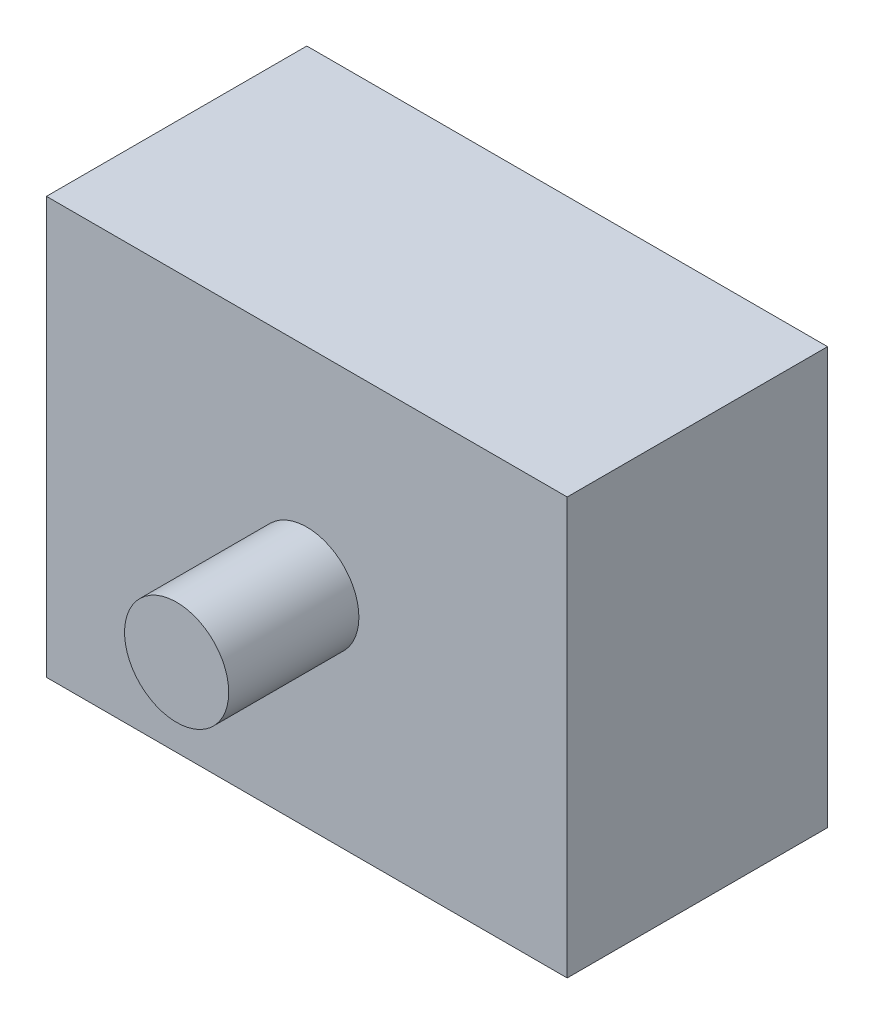
ISO-10303-21;
HEADER;
FILE_DESCRIPTION(('STEP AP214'),'2;1');
FILE_NAME('part.step','',(''),(''),'','','');
FILE_SCHEMA(('AUTOMOTIVE_DESIGN { 1 0 10303 214 1 1 1 1 }'));
ENDSEC;
DATA;
#1=APPLICATION_CONTEXT('core data for automotive mechanical design processes');
#2=APPLICATION_PROTOCOL_DEFINITION('international standard','automotive_design',2000,#1);
#3=PRODUCT_CONTEXT('',#1,'mechanical');
#4=PRODUCT('Part','Part','',(#3));
#5=PRODUCT_RELATED_PRODUCT_CATEGORY('part','',(#4));
#6=PRODUCT_DEFINITION_FORMATION('','',#4);
#7=PRODUCT_DEFINITION_CONTEXT('part definition',#1,'design');
#8=PRODUCT_DEFINITION('design','',#6,#7);
#9=PRODUCT_DEFINITION_SHAPE('','',#8);
#10=(LENGTH_UNIT() NAMED_UNIT(*) SI_UNIT(.MILLI.,.METRE.));
#11=(NAMED_UNIT(*) PLANE_ANGLE_UNIT() SI_UNIT($,.RADIAN.));
#12=(NAMED_UNIT(*) SI_UNIT($,.STERADIAN.) SOLID_ANGLE_UNIT());
#13=UNCERTAINTY_MEASURE_WITH_UNIT(LENGTH_MEASURE(1.E-05),#10,'distance_accuracy_value','');
#14=(GEOMETRIC_REPRESENTATION_CONTEXT(3) GLOBAL_UNCERTAINTY_ASSIGNED_CONTEXT((#13)) GLOBAL_UNIT_ASSIGNED_CONTEXT((#10,
#11,#12)) REPRESENTATION_CONTEXT('',''));
#15=CARTESIAN_POINT('',(0.,0.,0.));
#16=DIRECTION('',(0.,0.,1.));
#17=DIRECTION('',(1.,0.,0.));
#18=AXIS2_PLACEMENT_3D('',#15,#16,#17);
#19=CARTESIAN_POINT('',(0.,0.,10.));
#20=DIRECTION('',(0.,0.,-1.));
#21=DIRECTION('',(-1.,0.,0.));
#22=AXIS2_PLACEMENT_3D('',#19,#20,#21);
#23=PLANE('',#22);
#24=DIRECTION('',(0.,1.,0.));
#25=VECTOR('',#24,1.);
#26=CARTESIAN_POINT('',(9.99999999999999,-8.,10.));
#27=LINE('',#26,#25);
#28=CARTESIAN_POINT('',(9.99999999999999,-8.,10.));
#29=VERTEX_POINT('',#28);
#30=CARTESIAN_POINT('',(9.99999999999999,8.,10.));
#31=VERTEX_POINT('',#30);
#32=EDGE_CURVE('E85',#29,#31,#27,.T.);
#33=ORIENTED_EDGE('',*,*,#32,.T.);
#34=DIRECTION('',(-1.,0.,0.));
#35=VECTOR('',#34,1.);
#36=CARTESIAN_POINT('',(-10.,8.,10.));
#37=LINE('',#36,#35);
#38=CARTESIAN_POINT('',(-10.,8.,10.));
#39=VERTEX_POINT('',#38);
#40=EDGE_CURVE('E80',#31,#39,#37,.T.);
#41=ORIENTED_EDGE('',*,*,#40,.T.);
#42=DIRECTION('',(0.,-1.,0.));
#43=VECTOR('',#42,1.);
#44=CARTESIAN_POINT('',(-10.,-8.,10.));
#45=LINE('',#44,#43);
#46=CARTESIAN_POINT('',(-10.,-8.,10.));
#47=VERTEX_POINT('',#46);
#48=EDGE_CURVE('E83',#39,#47,#45,.T.);
#49=ORIENTED_EDGE('',*,*,#48,.T.);
#50=DIRECTION('',(1.,0.,0.));
#51=VECTOR('',#50,1.);
#52=CARTESIAN_POINT('',(-10.,-8.,10.));
#53=LINE('',#52,#51);
#54=EDGE_CURVE('E50',#47,#29,#53,.T.);
#55=ORIENTED_EDGE('',*,*,#54,.T.);
#56=EDGE_LOOP('',(#33,#41,#49,#55));
#57=FACE_BOUND('',#56,.T.);
#58=CARTESIAN_POINT('',(0.,0.,10.));
#59=DIRECTION('',(0.,0.,1.));
#60=DIRECTION('',(1.,0.,0.));
#61=AXIS2_PLACEMENT_3D('',#58,#59,#60);
#62=CIRCLE('',#61,2.);
#63=CARTESIAN_POINT('',(2.,0.,10.));
#64=VERTEX_POINT('',#63);
#65=EDGE_CURVE('E100',#64,#64,#62,.T.);
#66=ORIENTED_EDGE('',*,*,#65,.F.);
#67=EDGE_LOOP('',(#66));
#68=FACE_BOUND('',#67,.T.);
#69=ADVANCED_FACE('F33',(#57,#68),#23,.F.);
#70=CARTESIAN_POINT('',(0.,0.,0.));
#71=DIRECTION('',(0.,0.,-1.));
#72=DIRECTION('',(-1.,0.,0.));
#73=AXIS2_PLACEMENT_3D('',#70,#71,#72);
#74=PLANE('',#73);
#75=DIRECTION('',(0.,1.,0.));
#76=VECTOR('',#75,1.);
#77=CARTESIAN_POINT('',(9.99999999999999,-8.,0.));
#78=LINE('',#77,#76);
#79=CARTESIAN_POINT('',(9.99999999999999,-8.,0.));
#80=VERTEX_POINT('',#79);
#81=CARTESIAN_POINT('',(9.99999999999999,8.,0.));
#82=VERTEX_POINT('',#81);
#83=EDGE_CURVE('E97',#80,#82,#78,.T.);
#84=ORIENTED_EDGE('',*,*,#83,.F.);
#85=DIRECTION('',(1.,0.,0.));
#86=VECTOR('',#85,1.);
#87=CARTESIAN_POINT('',(-10.,-8.,0.));
#88=LINE('',#87,#86);
#89=CARTESIAN_POINT('',(-10.,-8.,0.));
#90=VERTEX_POINT('',#89);
#91=EDGE_CURVE('E73',#90,#80,#88,.T.);
#92=ORIENTED_EDGE('',*,*,#91,.F.);
#93=DIRECTION('',(0.,-1.,0.));
#94=VECTOR('',#93,1.);
#95=CARTESIAN_POINT('',(-10.,-8.,0.));
#96=LINE('',#95,#94);
#97=CARTESIAN_POINT('',(-10.,8.,0.));
#98=VERTEX_POINT('',#97);
#99=EDGE_CURVE('E67',#98,#90,#96,.T.);
#100=ORIENTED_EDGE('',*,*,#99,.F.);
#101=DIRECTION('',(-1.,0.,0.));
#102=VECTOR('',#101,1.);
#103=CARTESIAN_POINT('',(-10.,8.,0.));
#104=LINE('',#103,#102);
#105=EDGE_CURVE('E89',#82,#98,#104,.T.);
#106=ORIENTED_EDGE('',*,*,#105,.F.);
#107=EDGE_LOOP('',(#84,#92,#100,#106));
#108=FACE_BOUND('',#107,.T.);
#109=ADVANCED_FACE('F108',(#108),#74,.T.);
#110=CARTESIAN_POINT('',(9.99999999999999,-8.,10.));
#111=DIRECTION('',(-1.,0.,0.));
#112=DIRECTION('',(0.,0.,1.));
#113=AXIS2_PLACEMENT_3D('',#110,#111,#112);
#114=PLANE('',#113);
#115=ORIENTED_EDGE('',*,*,#83,.T.);
#116=DIRECTION('',(0.,0.,-1.));
#117=VECTOR('',#116,1.);
#118=CARTESIAN_POINT('',(9.99999999999999,8.,10.));
#119=LINE('',#118,#117);
#120=EDGE_CURVE('E11',#31,#82,#119,.T.);
#121=ORIENTED_EDGE('',*,*,#120,.F.);
#122=ORIENTED_EDGE('',*,*,#32,.F.);
#123=DIRECTION('',(0.,0.,-1.));
#124=VECTOR('',#123,1.);
#125=CARTESIAN_POINT('',(9.99999999999999,-8.,10.));
#126=LINE('',#125,#124);
#127=EDGE_CURVE('E93',#29,#80,#126,.T.);
#128=ORIENTED_EDGE('',*,*,#127,.T.);
#129=EDGE_LOOP('',(#115,#121,#122,#128));
#130=FACE_BOUND('',#129,.T.);
#131=ADVANCED_FACE('F35',(#130),#114,.F.);
#132=CARTESIAN_POINT('',(-10.,8.,10.));
#133=DIRECTION('',(0.,-1.,0.));
#134=DIRECTION('',(0.,0.,-1.));
#135=AXIS2_PLACEMENT_3D('',#132,#133,#134);
#136=PLANE('',#135);
#137=ORIENTED_EDGE('',*,*,#105,.T.);
#138=DIRECTION('',(0.,0.,-1.));
#139=VECTOR('',#138,1.);
#140=CARTESIAN_POINT('',(-10.,8.,10.));
#141=LINE('',#140,#139);
#142=EDGE_CURVE('E42',#39,#98,#141,.T.);
#143=ORIENTED_EDGE('',*,*,#142,.F.);
#144=ORIENTED_EDGE('',*,*,#40,.F.);
#145=ORIENTED_EDGE('',*,*,#120,.T.);
#146=EDGE_LOOP('',(#137,#143,#144,#145));
#147=FACE_BOUND('',#146,.T.);
#148=ADVANCED_FACE('F88',(#147),#136,.F.);
#149=CARTESIAN_POINT('',(-10.,-8.,10.));
#150=DIRECTION('',(1.,0.,0.));
#151=DIRECTION('',(0.,0.,-1.));
#152=AXIS2_PLACEMENT_3D('',#149,#150,#151);
#153=PLANE('',#152);
#154=ORIENTED_EDGE('',*,*,#99,.T.);
#155=DIRECTION('',(0.,0.,-1.));
#156=VECTOR('',#155,1.);
#157=CARTESIAN_POINT('',(-10.,-8.,10.));
#158=LINE('',#157,#156);
#159=EDGE_CURVE('E90',#47,#90,#158,.T.);
#160=ORIENTED_EDGE('',*,*,#159,.F.);
#161=ORIENTED_EDGE('',*,*,#48,.F.);
#162=ORIENTED_EDGE('',*,*,#142,.T.);
#163=EDGE_LOOP('',(#154,#160,#161,#162));
#164=FACE_BOUND('',#163,.T.);
#165=ADVANCED_FACE('F91',(#164),#153,.F.);
#166=CARTESIAN_POINT('',(-10.,-8.,10.));
#167=DIRECTION('',(0.,1.,0.));
#168=DIRECTION('',(0.,0.,1.));
#169=AXIS2_PLACEMENT_3D('',#166,#167,#168);
#170=PLANE('',#169);
#171=ORIENTED_EDGE('',*,*,#91,.T.);
#172=ORIENTED_EDGE('',*,*,#127,.F.);
#173=ORIENTED_EDGE('',*,*,#54,.F.);
#174=ORIENTED_EDGE('',*,*,#159,.T.);
#175=EDGE_LOOP('',(#171,#172,#173,#174));
#176=FACE_BOUND('',#175,.T.);
#177=ADVANCED_FACE('F105',(#176),#170,.F.);
#178=CARTESIAN_POINT('',(0.,0.,15.));
#179=DIRECTION('',(0.,0.,-1.));
#180=DIRECTION('',(-1.,0.,0.));
#181=AXIS2_PLACEMENT_3D('',#178,#179,#180);
#182=CYLINDRICAL_SURFACE('',#181,2.);
#183=CARTESIAN_POINT('',(0.,0.,15.));
#184=DIRECTION('',(0.,0.,1.));
#185=DIRECTION('',(1.,0.,0.));
#186=AXIS2_PLACEMENT_3D('',#183,#184,#185);
#187=CIRCLE('',#186,2.);
#188=CARTESIAN_POINT('',(2.,0.,15.));
#189=VERTEX_POINT('',#188);
#190=EDGE_CURVE('E113',#189,#189,#187,.T.);
#191=ORIENTED_EDGE('',*,*,#190,.F.);
#192=EDGE_LOOP('',(#191));
#193=FACE_BOUND('',#192,.T.);
#194=ORIENTED_EDGE('',*,*,#65,.T.);
#195=EDGE_LOOP('',(#194));
#196=FACE_BOUND('',#195,.T.);
#197=ADVANCED_FACE('F119',(#193,#196),#182,.T.);
#198=CARTESIAN_POINT('',(0.,0.,15.));
#199=DIRECTION('',(0.,0.,1.));
#200=DIRECTION('',(1.,0.,0.));
#201=AXIS2_PLACEMENT_3D('',#198,#199,#200);
#202=PLANE('',#201);
#203=ORIENTED_EDGE('',*,*,#190,.T.);
#204=EDGE_LOOP('',(#203));
#205=FACE_BOUND('',#204,.T.);
#206=ADVANCED_FACE('F117',(#205),#202,.T.);
#207=CLOSED_SHELL('',(#69,#109,#131,#148,#165,#177,#197,#206));
#208=MANIFOLD_SOLID_BREP('B2',#207);
#209=ADVANCED_BREP_SHAPE_REPRESENTATION('',(#18,#208),#14);
#210=SHAPE_DEFINITION_REPRESENTATION(#9,#209);
ENDSEC;
END-ISO-10303-21;
